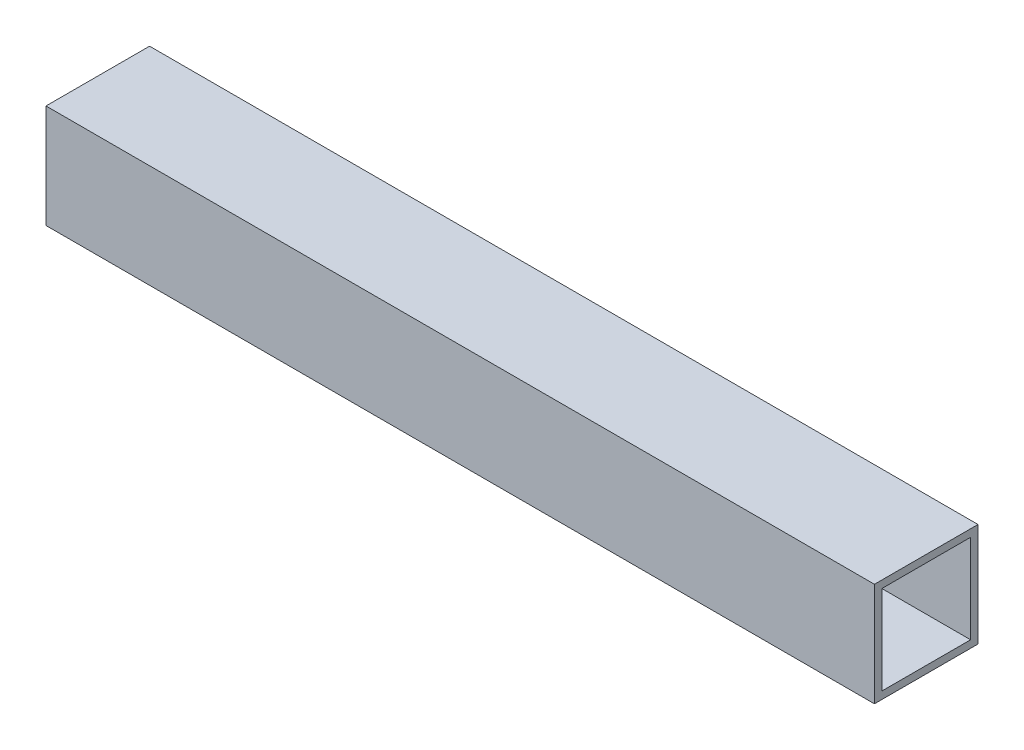
ISO-10303-21;
HEADER;
FILE_DESCRIPTION(('STEP AP214'),'2;1');
FILE_NAME('part.step','',(''),(''),'','','');
FILE_SCHEMA(('AUTOMOTIVE_DESIGN { 1 0 10303 214 1 1 1 1 }'));
ENDSEC;
DATA;
#1=APPLICATION_CONTEXT('core data for automotive mechanical design processes');
#2=APPLICATION_PROTOCOL_DEFINITION('international standard','automotive_design',2000,#1);
#3=PRODUCT_CONTEXT('',#1,'mechanical');
#4=PRODUCT('Part','Part','',(#3));
#5=PRODUCT_RELATED_PRODUCT_CATEGORY('part','',(#4));
#6=PRODUCT_DEFINITION_FORMATION('','',#4);
#7=PRODUCT_DEFINITION_CONTEXT('part definition',#1,'design');
#8=PRODUCT_DEFINITION('design','',#6,#7);
#9=PRODUCT_DEFINITION_SHAPE('','',#8);
#10=(LENGTH_UNIT() NAMED_UNIT(*) SI_UNIT(.MILLI.,.METRE.));
#11=(NAMED_UNIT(*) PLANE_ANGLE_UNIT() SI_UNIT($,.RADIAN.));
#12=(NAMED_UNIT(*) SI_UNIT($,.STERADIAN.) SOLID_ANGLE_UNIT());
#13=UNCERTAINTY_MEASURE_WITH_UNIT(LENGTH_MEASURE(1.E-05),#10,'distance_accuracy_value','');
#14=(GEOMETRIC_REPRESENTATION_CONTEXT(3) GLOBAL_UNCERTAINTY_ASSIGNED_CONTEXT((#13)) GLOBAL_UNIT_ASSIGNED_CONTEXT((#10,
#11,#12)) REPRESENTATION_CONTEXT('',''));
#15=CARTESIAN_POINT('',(0.,0.,0.));
#16=DIRECTION('',(0.,0.,1.));
#17=DIRECTION('',(1.,0.,0.));
#18=AXIS2_PLACEMENT_3D('',#15,#16,#17);
#19=CARTESIAN_POINT('',(355.6,0.,0.));
#20=DIRECTION('',(-1.,0.,0.));
#21=DIRECTION('',(0.,0.,1.));
#22=AXIS2_PLACEMENT_3D('',#19,#20,#21);
#23=PLANE('',#22);
#24=DIRECTION('',(0.,-1.,0.));
#25=VECTOR('',#24,1.);
#26=CARTESIAN_POINT('',(355.6,0.,0.));
#27=LINE('',#26,#25);
#28=CARTESIAN_POINT('',(355.6,44.45,0.));
#29=VERTEX_POINT('',#28);
#30=CARTESIAN_POINT('',(355.6,0.,0.));
#31=VERTEX_POINT('',#30);
#32=EDGE_CURVE('E138',#29,#31,#27,.T.);
#33=ORIENTED_EDGE('',*,*,#32,.T.);
#34=DIRECTION('',(0.,0.,-1.));
#35=VECTOR('',#34,1.);
#36=CARTESIAN_POINT('',(355.6,0.,0.));
#37=LINE('',#36,#35);
#38=CARTESIAN_POINT('',(355.6,0.,-44.45));
#39=VERTEX_POINT('',#38);
#40=EDGE_CURVE('E141',#31,#39,#37,.T.);
#41=ORIENTED_EDGE('',*,*,#40,.T.);
#42=DIRECTION('',(0.,1.,0.));
#43=VECTOR('',#42,1.);
#44=CARTESIAN_POINT('',(355.6,0.,-44.45));
#45=LINE('',#44,#43);
#46=CARTESIAN_POINT('',(355.6,44.45,-44.45));
#47=VERTEX_POINT('',#46);
#48=EDGE_CURVE('E144',#39,#47,#45,.T.);
#49=ORIENTED_EDGE('',*,*,#48,.T.);
#50=DIRECTION('',(0.,0.,1.));
#51=VECTOR('',#50,1.);
#52=CARTESIAN_POINT('',(355.6,44.45,0.));
#53=LINE('',#52,#51);
#54=EDGE_CURVE('E146',#47,#29,#53,.T.);
#55=ORIENTED_EDGE('',*,*,#54,.T.);
#56=EDGE_LOOP('',(#33,#41,#49,#55));
#57=FACE_BOUND('',#56,.T.);
#58=DIRECTION('',(0.,1.,0.));
#59=VECTOR('',#58,1.);
#60=CARTESIAN_POINT('',(355.6,41.275,-41.275));
#61=LINE('',#60,#59);
#62=CARTESIAN_POINT('',(355.6,3.175,-41.275));
#63=VERTEX_POINT('',#62);
#64=CARTESIAN_POINT('',(355.6,41.275,-41.275));
#65=VERTEX_POINT('',#64);
#66=EDGE_CURVE('E102',#63,#65,#61,.T.);
#67=ORIENTED_EDGE('',*,*,#66,.F.);
#68=DIRECTION('',(0.,0.,-1.));
#69=VECTOR('',#68,1.);
#70=CARTESIAN_POINT('',(355.6,3.175,-41.275));
#71=LINE('',#70,#69);
#72=CARTESIAN_POINT('',(355.6,3.17499999999999,-3.175));
#73=VERTEX_POINT('',#72);
#74=EDGE_CURVE('E124',#73,#63,#71,.T.);
#75=ORIENTED_EDGE('',*,*,#74,.F.);
#76=DIRECTION('',(0.,-1.,0.));
#77=VECTOR('',#76,1.);
#78=CARTESIAN_POINT('',(355.6,41.275,-3.175));
#79=LINE('',#78,#77);
#80=CARTESIAN_POINT('',(355.6,41.275,-3.175));
#81=VERTEX_POINT('',#80);
#82=EDGE_CURVE('E122',#81,#73,#79,.T.);
#83=ORIENTED_EDGE('',*,*,#82,.F.);
#84=DIRECTION('',(0.,0.,1.));
#85=VECTOR('',#84,1.);
#86=CARTESIAN_POINT('',(355.6,41.275,-41.275));
#87=LINE('',#86,#85);
#88=EDGE_CURVE('E110',#65,#81,#87,.T.);
#89=ORIENTED_EDGE('',*,*,#88,.F.);
#90=EDGE_LOOP('',(#67,#75,#83,#89));
#91=FACE_BOUND('',#90,.T.);
#92=ADVANCED_FACE('F37',(#57,#91),#23,.F.);
#93=CARTESIAN_POINT('',(0.,0.,0.));
#94=DIRECTION('',(-1.,0.,0.));
#95=DIRECTION('',(0.,0.,1.));
#96=AXIS2_PLACEMENT_3D('',#93,#94,#95);
#97=PLANE('',#96);
#98=DIRECTION('',(0.,-1.,0.));
#99=VECTOR('',#98,1.);
#100=CARTESIAN_POINT('',(0.,0.,0.));
#101=LINE('',#100,#99);
#102=CARTESIAN_POINT('',(0.,44.45,0.));
#103=VERTEX_POINT('',#102);
#104=CARTESIAN_POINT('',(0.,0.,0.));
#105=VERTEX_POINT('',#104);
#106=EDGE_CURVE('E118',#103,#105,#101,.T.);
#107=ORIENTED_EDGE('',*,*,#106,.F.);
#108=DIRECTION('',(0.,0.,1.));
#109=VECTOR('',#108,1.);
#110=CARTESIAN_POINT('',(0.,44.45,0.));
#111=LINE('',#110,#109);
#112=CARTESIAN_POINT('',(0.,44.45,-44.45));
#113=VERTEX_POINT('',#112);
#114=EDGE_CURVE('E142',#113,#103,#111,.T.);
#115=ORIENTED_EDGE('',*,*,#114,.F.);
#116=DIRECTION('',(0.,1.,0.));
#117=VECTOR('',#116,1.);
#118=CARTESIAN_POINT('',(0.,0.,-44.45));
#119=LINE('',#118,#117);
#120=CARTESIAN_POINT('',(0.,0.,-44.45));
#121=VERTEX_POINT('',#120);
#122=EDGE_CURVE('E153',#121,#113,#119,.T.);
#123=ORIENTED_EDGE('',*,*,#122,.F.);
#124=DIRECTION('',(0.,0.,-1.));
#125=VECTOR('',#124,1.);
#126=CARTESIAN_POINT('',(0.,0.,0.));
#127=LINE('',#126,#125);
#128=EDGE_CURVE('E151',#105,#121,#127,.T.);
#129=ORIENTED_EDGE('',*,*,#128,.F.);
#130=EDGE_LOOP('',(#107,#115,#123,#129));
#131=FACE_BOUND('',#130,.T.);
#132=DIRECTION('',(0.,0.,-1.));
#133=VECTOR('',#132,1.);
#134=CARTESIAN_POINT('',(0.,3.175,-41.275));
#135=LINE('',#134,#133);
#136=CARTESIAN_POINT('',(0.,3.17499999999999,-3.175));
#137=VERTEX_POINT('',#136);
#138=CARTESIAN_POINT('',(0.,3.175,-41.275));
#139=VERTEX_POINT('',#138);
#140=EDGE_CURVE('E111',#137,#139,#135,.T.);
#141=ORIENTED_EDGE('',*,*,#140,.T.);
#142=DIRECTION('',(0.,1.,0.));
#143=VECTOR('',#142,1.);
#144=CARTESIAN_POINT('',(0.,41.275,-41.275));
#145=LINE('',#144,#143);
#146=CARTESIAN_POINT('',(0.,41.275,-41.275));
#147=VERTEX_POINT('',#146);
#148=EDGE_CURVE('E60',#139,#147,#145,.T.);
#149=ORIENTED_EDGE('',*,*,#148,.T.);
#150=DIRECTION('',(0.,0.,1.));
#151=VECTOR('',#150,1.);
#152=CARTESIAN_POINT('',(0.,41.275,-41.275));
#153=LINE('',#152,#151);
#154=CARTESIAN_POINT('',(0.,41.275,-3.175));
#155=VERTEX_POINT('',#154);
#156=EDGE_CURVE('E117',#147,#155,#153,.T.);
#157=ORIENTED_EDGE('',*,*,#156,.T.);
#158=DIRECTION('',(0.,-1.,0.));
#159=VECTOR('',#158,1.);
#160=CARTESIAN_POINT('',(0.,41.275,-3.175));
#161=LINE('',#160,#159);
#162=EDGE_CURVE('E130',#155,#137,#161,.T.);
#163=ORIENTED_EDGE('',*,*,#162,.T.);
#164=EDGE_LOOP('',(#141,#149,#157,#163));
#165=FACE_BOUND('',#164,.T.);
#166=ADVANCED_FACE('F171',(#131,#165),#97,.T.);
#167=CARTESIAN_POINT('',(355.6,0.,0.));
#168=DIRECTION('',(0.,0.,-1.));
#169=DIRECTION('',(-1.,0.,0.));
#170=AXIS2_PLACEMENT_3D('',#167,#168,#169);
#171=PLANE('',#170);
#172=ORIENTED_EDGE('',*,*,#106,.T.);
#173=DIRECTION('',(-1.,0.,0.));
#174=VECTOR('',#173,1.);
#175=CARTESIAN_POINT('',(355.6,0.,0.));
#176=LINE('',#175,#174);
#177=EDGE_CURVE('E11',#31,#105,#176,.T.);
#178=ORIENTED_EDGE('',*,*,#177,.F.);
#179=ORIENTED_EDGE('',*,*,#32,.F.);
#180=DIRECTION('',(-1.,0.,0.));
#181=VECTOR('',#180,1.);
#182=CARTESIAN_POINT('',(355.6,44.45,0.));
#183=LINE('',#182,#181);
#184=EDGE_CURVE('E148',#29,#103,#183,.T.);
#185=ORIENTED_EDGE('',*,*,#184,.T.);
#186=EDGE_LOOP('',(#172,#178,#179,#185));
#187=FACE_BOUND('',#186,.T.);
#188=ADVANCED_FACE('F39',(#187),#171,.F.);
#189=CARTESIAN_POINT('',(355.6,0.,0.));
#190=DIRECTION('',(0.,1.,0.));
#191=DIRECTION('',(0.,0.,1.));
#192=AXIS2_PLACEMENT_3D('',#189,#190,#191);
#193=PLANE('',#192);
#194=ORIENTED_EDGE('',*,*,#128,.T.);
#195=DIRECTION('',(-1.,0.,0.));
#196=VECTOR('',#195,1.);
#197=CARTESIAN_POINT('',(355.6,0.,-44.45));
#198=LINE('',#197,#196);
#199=EDGE_CURVE('E45',#39,#121,#198,.T.);
#200=ORIENTED_EDGE('',*,*,#199,.F.);
#201=ORIENTED_EDGE('',*,*,#40,.F.);
#202=ORIENTED_EDGE('',*,*,#177,.T.);
#203=EDGE_LOOP('',(#194,#200,#201,#202));
#204=FACE_BOUND('',#203,.T.);
#205=ADVANCED_FACE('F181',(#204),#193,.F.);
#206=CARTESIAN_POINT('',(355.6,0.,-44.45));
#207=DIRECTION('',(0.,0.,1.));
#208=DIRECTION('',(1.,0.,0.));
#209=AXIS2_PLACEMENT_3D('',#206,#207,#208);
#210=PLANE('',#209);
#211=ORIENTED_EDGE('',*,*,#122,.T.);
#212=DIRECTION('',(-1.,0.,0.));
#213=VECTOR('',#212,1.);
#214=CARTESIAN_POINT('',(355.6,44.45,-44.45));
#215=LINE('',#214,#213);
#216=EDGE_CURVE('E158',#47,#113,#215,.T.);
#217=ORIENTED_EDGE('',*,*,#216,.F.);
#218=ORIENTED_EDGE('',*,*,#48,.F.);
#219=ORIENTED_EDGE('',*,*,#199,.T.);
#220=EDGE_LOOP('',(#211,#217,#218,#219));
#221=FACE_BOUND('',#220,.T.);
#222=ADVANCED_FACE('F165',(#221),#210,.F.);
#223=CARTESIAN_POINT('',(355.6,44.45,0.));
#224=DIRECTION('',(0.,-1.,0.));
#225=DIRECTION('',(0.,0.,-1.));
#226=AXIS2_PLACEMENT_3D('',#223,#224,#225);
#227=PLANE('',#226);
#228=ORIENTED_EDGE('',*,*,#114,.T.);
#229=ORIENTED_EDGE('',*,*,#184,.F.);
#230=ORIENTED_EDGE('',*,*,#54,.F.);
#231=ORIENTED_EDGE('',*,*,#216,.T.);
#232=EDGE_LOOP('',(#228,#229,#230,#231));
#233=FACE_BOUND('',#232,.T.);
#234=ADVANCED_FACE('F175',(#233),#227,.F.);
#235=CARTESIAN_POINT('',(355.6,41.275,-41.275));
#236=DIRECTION('',(0.,0.,1.));
#237=DIRECTION('',(0.,-1.,0.));
#238=AXIS2_PLACEMENT_3D('',#235,#236,#237);
#239=PLANE('',#238);
#240=ORIENTED_EDGE('',*,*,#148,.F.);
#241=DIRECTION('',(-1.,0.,0.));
#242=VECTOR('',#241,1.);
#243=CARTESIAN_POINT('',(355.6,3.175,-41.275));
#244=LINE('',#243,#242);
#245=EDGE_CURVE('E106',#63,#139,#244,.T.);
#246=ORIENTED_EDGE('',*,*,#245,.F.);
#247=ORIENTED_EDGE('',*,*,#66,.T.);
#248=DIRECTION('',(-1.,0.,0.));
#249=VECTOR('',#248,1.);
#250=CARTESIAN_POINT('',(355.6,41.275,-41.275));
#251=LINE('',#250,#249);
#252=EDGE_CURVE('E105',#65,#147,#251,.T.);
#253=ORIENTED_EDGE('',*,*,#252,.T.);
#254=EDGE_LOOP('',(#240,#246,#247,#253));
#255=FACE_BOUND('',#254,.T.);
#256=ADVANCED_FACE('F104',(#255),#239,.T.);
#257=CARTESIAN_POINT('',(355.6,41.275,-41.275));
#258=DIRECTION('',(0.,-1.,0.));
#259=DIRECTION('',(0.,0.,-1.));
#260=AXIS2_PLACEMENT_3D('',#257,#258,#259);
#261=PLANE('',#260);
#262=ORIENTED_EDGE('',*,*,#156,.F.);
#263=ORIENTED_EDGE('',*,*,#252,.F.);
#264=ORIENTED_EDGE('',*,*,#88,.T.);
#265=DIRECTION('',(-1.,0.,0.));
#266=VECTOR('',#265,1.);
#267=CARTESIAN_POINT('',(355.6,41.275,-3.175));
#268=LINE('',#267,#266);
#269=EDGE_CURVE('E119',#81,#155,#268,.T.);
#270=ORIENTED_EDGE('',*,*,#269,.T.);
#271=EDGE_LOOP('',(#262,#263,#264,#270));
#272=FACE_BOUND('',#271,.T.);
#273=ADVANCED_FACE('F114',(#272),#261,.T.);
#274=CARTESIAN_POINT('',(355.6,41.275,-3.175));
#275=DIRECTION('',(0.,0.,-1.));
#276=DIRECTION('',(0.,1.,0.));
#277=AXIS2_PLACEMENT_3D('',#274,#275,#276);
#278=PLANE('',#277);
#279=ORIENTED_EDGE('',*,*,#162,.F.);
#280=ORIENTED_EDGE('',*,*,#269,.F.);
#281=ORIENTED_EDGE('',*,*,#82,.T.);
#282=DIRECTION('',(-1.,0.,0.));
#283=VECTOR('',#282,1.);
#284=CARTESIAN_POINT('',(355.6,3.17499999999999,-3.175));
#285=LINE('',#284,#283);
#286=EDGE_CURVE('E52',#73,#137,#285,.T.);
#287=ORIENTED_EDGE('',*,*,#286,.T.);
#288=EDGE_LOOP('',(#279,#280,#281,#287));
#289=FACE_BOUND('',#288,.T.);
#290=ADVANCED_FACE('F204',(#289),#278,.T.);
#291=CARTESIAN_POINT('',(355.6,3.175,-41.275));
#292=DIRECTION('',(0.,1.,0.));
#293=DIRECTION('',(0.,0.,1.));
#294=AXIS2_PLACEMENT_3D('',#291,#292,#293);
#295=PLANE('',#294);
#296=ORIENTED_EDGE('',*,*,#140,.F.);
#297=ORIENTED_EDGE('',*,*,#286,.F.);
#298=ORIENTED_EDGE('',*,*,#74,.T.);
#299=ORIENTED_EDGE('',*,*,#245,.T.);
#300=EDGE_LOOP('',(#296,#297,#298,#299));
#301=FACE_BOUND('',#300,.T.);
#302=ADVANCED_FACE('F208',(#301),#295,.T.);
#303=CLOSED_SHELL('',(#92,#166,#188,#205,#222,#234,#256,#273,#290,#302));
#304=MANIFOLD_SOLID_BREP('B2',#303);
#305=ADVANCED_BREP_SHAPE_REPRESENTATION('',(#18,#304),#14);
#306=SHAPE_DEFINITION_REPRESENTATION(#9,#305);
ENDSEC;
END-ISO-10303-21;
